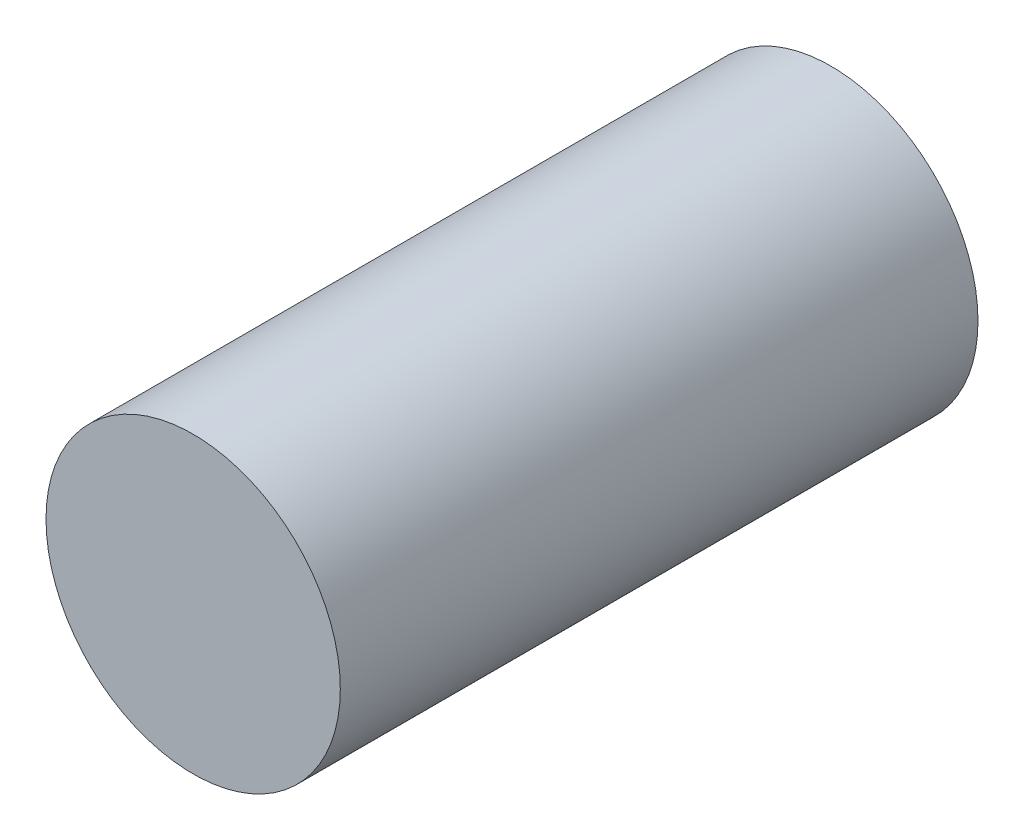
ISO-10303-21;
HEADER;
FILE_DESCRIPTION(('STEP AP214'),'2;1');
FILE_NAME('part.step','',(''),(''),'','','');
FILE_SCHEMA(('AUTOMOTIVE_DESIGN { 1 0 10303 214 1 1 1 1 }'));
ENDSEC;
DATA;
#1=APPLICATION_CONTEXT('core data for automotive mechanical design processes');
#2=APPLICATION_PROTOCOL_DEFINITION('international standard','automotive_design',2000,#1);
#3=PRODUCT_CONTEXT('',#1,'mechanical');
#4=PRODUCT('Part','Part','',(#3));
#5=PRODUCT_RELATED_PRODUCT_CATEGORY('part','',(#4));
#6=PRODUCT_DEFINITION_FORMATION('','',#4);
#7=PRODUCT_DEFINITION_CONTEXT('part definition',#1,'design');
#8=PRODUCT_DEFINITION('design','',#6,#7);
#9=PRODUCT_DEFINITION_SHAPE('','',#8);
#10=(LENGTH_UNIT() NAMED_UNIT(*) SI_UNIT(.MILLI.,.METRE.));
#11=(NAMED_UNIT(*) PLANE_ANGLE_UNIT() SI_UNIT($,.RADIAN.));
#12=(NAMED_UNIT(*) SI_UNIT($,.STERADIAN.) SOLID_ANGLE_UNIT());
#13=UNCERTAINTY_MEASURE_WITH_UNIT(LENGTH_MEASURE(1.E-05),#10,'distance_accuracy_value','');
#14=(GEOMETRIC_REPRESENTATION_CONTEXT(3) GLOBAL_UNCERTAINTY_ASSIGNED_CONTEXT((#13)) GLOBAL_UNIT_ASSIGNED_CONTEXT((#10,
#11,#12)) REPRESENTATION_CONTEXT('',''));
#15=CARTESIAN_POINT('',(0.,0.,0.));
#16=DIRECTION('',(0.,0.,1.));
#17=DIRECTION('',(1.,0.,0.));
#18=AXIS2_PLACEMENT_3D('',#15,#16,#17);
#19=CARTESIAN_POINT('',(0.,0.,130.));
#20=DIRECTION('',(0.,0.,-1.));
#21=DIRECTION('',(-1.,0.,0.));
#22=AXIS2_PLACEMENT_3D('',#19,#20,#21);
#23=CYLINDRICAL_SURFACE('',#22,30.);
#24=CARTESIAN_POINT('',(0.,0.,130.));
#25=DIRECTION('',(0.,0.,1.));
#26=DIRECTION('',(1.,0.,0.));
#27=AXIS2_PLACEMENT_3D('',#24,#25,#26);
#28=CIRCLE('',#27,30.);
#29=CARTESIAN_POINT('',(30.,0.,130.));
#30=VERTEX_POINT('',#29);
#31=EDGE_CURVE('E10',#30,#30,#28,.T.);
#32=ORIENTED_EDGE('',*,*,#31,.F.);
#33=EDGE_LOOP('',(#32));
#34=FACE_BOUND('',#33,.T.);
#35=CARTESIAN_POINT('',(0.,0.,0.));
#36=DIRECTION('',(0.,0.,1.));
#37=DIRECTION('',(1.,0.,0.));
#38=AXIS2_PLACEMENT_3D('',#35,#36,#37);
#39=CIRCLE('',#38,30.);
#40=CARTESIAN_POINT('',(30.,0.,0.));
#41=VERTEX_POINT('',#40);
#42=EDGE_CURVE('E34',#41,#41,#39,.T.);
#43=ORIENTED_EDGE('',*,*,#42,.T.);
#44=EDGE_LOOP('',(#43));
#45=FACE_BOUND('',#44,.T.);
#46=ADVANCED_FACE('F31',(#34,#45),#23,.T.);
#47=CARTESIAN_POINT('',(0.,0.,130.));
#48=DIRECTION('',(0.,0.,1.));
#49=DIRECTION('',(1.,0.,0.));
#50=AXIS2_PLACEMENT_3D('',#47,#48,#49);
#51=PLANE('',#50);
#52=ORIENTED_EDGE('',*,*,#31,.T.);
#53=EDGE_LOOP('',(#52));
#54=FACE_BOUND('',#53,.T.);
#55=ADVANCED_FACE('F46',(#54),#51,.T.);
#56=CARTESIAN_POINT('',(0.,0.,0.));
#57=DIRECTION('',(0.,0.,1.));
#58=DIRECTION('',(1.,0.,0.));
#59=AXIS2_PLACEMENT_3D('',#56,#57,#58);
#60=PLANE('',#59);
#61=ORIENTED_EDGE('',*,*,#42,.F.);
#62=EDGE_LOOP('',(#61));
#63=FACE_BOUND('',#62,.T.);
#64=ADVANCED_FACE('F44',(#63),#60,.F.);
#65=CLOSED_SHELL('',(#46,#55,#64));
#66=MANIFOLD_SOLID_BREP('B2',#65);
#67=ADVANCED_BREP_SHAPE_REPRESENTATION('',(#18,#66),#14);
#68=SHAPE_DEFINITION_REPRESENTATION(#9,#67);
ENDSEC;
END-ISO-10303-21;
